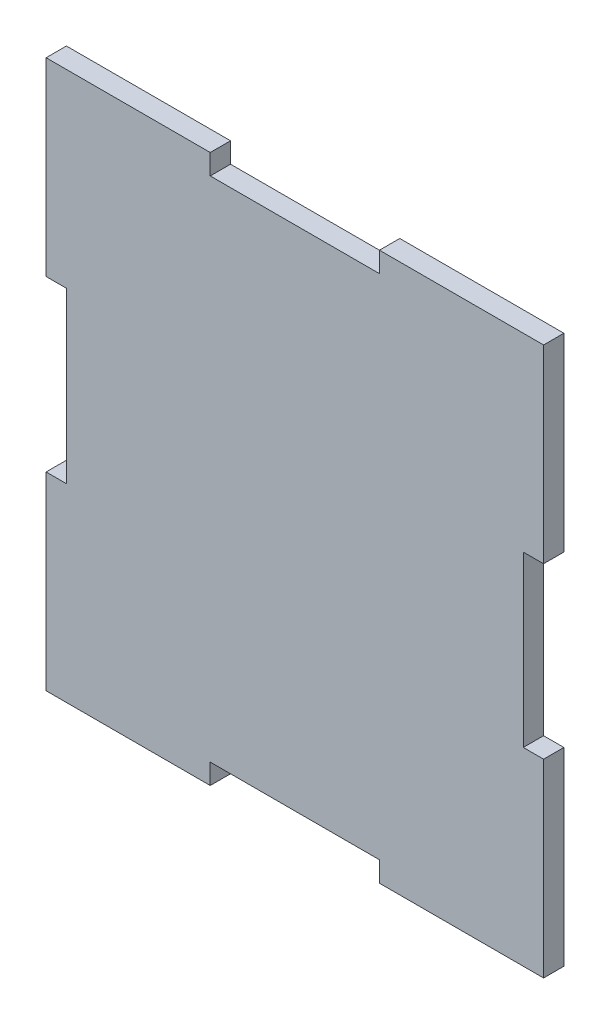
ISO-10303-21;
HEADER;
FILE_DESCRIPTION(('STEP AP214'),'2;1');
FILE_NAME('part.step','',(''),(''),'','','');
FILE_SCHEMA(('AUTOMOTIVE_DESIGN { 1 0 10303 214 1 1 1 1 }'));
ENDSEC;
DATA;
#1=APPLICATION_CONTEXT('core data for automotive mechanical design processes');
#2=APPLICATION_PROTOCOL_DEFINITION('international standard','automotive_design',2000,#1);
#3=PRODUCT_CONTEXT('',#1,'mechanical');
#4=PRODUCT('Part','Part','',(#3));
#5=PRODUCT_RELATED_PRODUCT_CATEGORY('part','',(#4));
#6=PRODUCT_DEFINITION_FORMATION('','',#4);
#7=PRODUCT_DEFINITION_CONTEXT('part definition',#1,'design');
#8=PRODUCT_DEFINITION('design','',#6,#7);
#9=PRODUCT_DEFINITION_SHAPE('','',#8);
#10=(LENGTH_UNIT() NAMED_UNIT(*) SI_UNIT(.MILLI.,.METRE.));
#11=(NAMED_UNIT(*) PLANE_ANGLE_UNIT() SI_UNIT($,.RADIAN.));
#12=(NAMED_UNIT(*) SI_UNIT($,.STERADIAN.) SOLID_ANGLE_UNIT());
#13=UNCERTAINTY_MEASURE_WITH_UNIT(LENGTH_MEASURE(1.E-05),#10,'distance_accuracy_value','');
#14=(GEOMETRIC_REPRESENTATION_CONTEXT(3) GLOBAL_UNCERTAINTY_ASSIGNED_CONTEXT((#13)) GLOBAL_UNIT_ASSIGNED_CONTEXT((#10,
#11,#12)) REPRESENTATION_CONTEXT('',''));
#15=CARTESIAN_POINT('',(0.,0.,0.));
#16=DIRECTION('',(0.,0.,1.));
#17=DIRECTION('',(1.,0.,0.));
#18=AXIS2_PLACEMENT_3D('',#15,#16,#17);
#19=CARTESIAN_POINT('',(-67.4999999999999,0.,6.));
#20=DIRECTION('',(-1.,0.,0.));
#21=DIRECTION('',(0.,0.,1.));
#22=AXIS2_PLACEMENT_3D('',#19,#20,#21);
#23=PLANE('',#22);
#24=DIRECTION('',(0.,1.,0.));
#25=VECTOR('',#24,1.);
#26=CARTESIAN_POINT('',(-67.4999999999999,0.,0.));
#27=LINE('',#26,#25);
#28=CARTESIAN_POINT('',(-67.4999999999999,-25.0000000000058,0.));
#29=VERTEX_POINT('',#28);
#30=CARTESIAN_POINT('',(-67.4999999999999,24.9999999999942,0.));
#31=VERTEX_POINT('',#30);
#32=EDGE_CURVE('E199',#29,#31,#27,.T.);
#33=ORIENTED_EDGE('',*,*,#32,.F.);
#34=DIRECTION('',(0.,0.,-1.));
#35=VECTOR('',#34,1.);
#36=CARTESIAN_POINT('',(-67.4999999999999,-25.0000000000058,6.));
#37=LINE('',#36,#35);
#38=CARTESIAN_POINT('',(-67.4999999999999,-25.0000000000058,6.));
#39=VERTEX_POINT('',#38);
#40=EDGE_CURVE('E11',#39,#29,#37,.T.);
#41=ORIENTED_EDGE('',*,*,#40,.F.);
#42=DIRECTION('',(0.,1.,0.));
#43=VECTOR('',#42,1.);
#44=CARTESIAN_POINT('',(-67.4999999999999,0.,6.));
#45=LINE('',#44,#43);
#46=CARTESIAN_POINT('',(-67.4999999999999,24.9999999999942,6.));
#47=VERTEX_POINT('',#46);
#48=EDGE_CURVE('E251',#39,#47,#45,.T.);
#49=ORIENTED_EDGE('',*,*,#48,.T.);
#50=DIRECTION('',(0.,0.,-1.));
#51=VECTOR('',#50,1.);
#52=CARTESIAN_POINT('',(-67.4999999999999,24.9999999999942,6.));
#53=LINE('',#52,#51);
#54=EDGE_CURVE('E120',#47,#31,#53,.T.);
#55=ORIENTED_EDGE('',*,*,#54,.T.);
#56=EDGE_LOOP('',(#33,#41,#49,#55));
#57=FACE_BOUND('',#56,.T.);
#58=ADVANCED_FACE('F34',(#57),#23,.T.);
#59=CARTESIAN_POINT('',(0.,-25.0000000000056,6.));
#60=DIRECTION('',(0.,1.,0.));
#61=DIRECTION('',(-1.,0.,0.));
#62=AXIS2_PLACEMENT_3D('',#59,#60,#61);
#63=PLANE('',#62);
#64=DIRECTION('',(1.,0.,0.));
#65=VECTOR('',#64,1.);
#66=CARTESIAN_POINT('',(0.,-25.0000000000056,0.));
#67=LINE('',#66,#65);
#68=CARTESIAN_POINT('',(-73.4999999999999,-25.0000000000058,0.));
#69=VERTEX_POINT('',#68);
#70=EDGE_CURVE('E202',#69,#29,#67,.T.);
#71=ORIENTED_EDGE('',*,*,#70,.F.);
#72=DIRECTION('',(0.,0.,-1.));
#73=VECTOR('',#72,1.);
#74=CARTESIAN_POINT('',(-73.4999999999999,-25.0000000000058,6.));
#75=LINE('',#74,#73);
#76=CARTESIAN_POINT('',(-73.4999999999999,-25.0000000000058,6.));
#77=VERTEX_POINT('',#76);
#78=EDGE_CURVE('E42',#77,#69,#75,.T.);
#79=ORIENTED_EDGE('',*,*,#78,.F.);
#80=DIRECTION('',(1.,0.,0.));
#81=VECTOR('',#80,1.);
#82=CARTESIAN_POINT('',(0.,-25.0000000000056,6.));
#83=LINE('',#82,#81);
#84=EDGE_CURVE('E300',#77,#39,#83,.T.);
#85=ORIENTED_EDGE('',*,*,#84,.T.);
#86=ORIENTED_EDGE('',*,*,#40,.T.);
#87=EDGE_LOOP('',(#71,#79,#85,#86));
#88=FACE_BOUND('',#87,.T.);
#89=ADVANCED_FACE('F299',(#88),#63,.T.);
#90=CARTESIAN_POINT('',(-73.4999999999999,0.,6.));
#91=DIRECTION('',(1.,0.,0.));
#92=DIRECTION('',(0.,0.,-1.));
#93=AXIS2_PLACEMENT_3D('',#90,#91,#92);
#94=PLANE('',#93);
#95=DIRECTION('',(0.,-1.,0.));
#96=VECTOR('',#95,1.);
#97=CARTESIAN_POINT('',(-73.4999999999999,0.,0.));
#98=LINE('',#97,#96);
#99=CARTESIAN_POINT('',(-73.4999999999999,-80.9999999999941,0.));
#100=VERTEX_POINT('',#99);
#101=EDGE_CURVE('E205',#69,#100,#98,.T.);
#102=ORIENTED_EDGE('',*,*,#101,.T.);
#103=DIRECTION('',(0.,0.,-1.));
#104=VECTOR('',#103,1.);
#105=CARTESIAN_POINT('',(-73.4999999999999,-80.9999999999941,6.));
#106=LINE('',#105,#104);
#107=CARTESIAN_POINT('',(-73.4999999999999,-80.9999999999941,6.));
#108=VERTEX_POINT('',#107);
#109=EDGE_CURVE('E283',#108,#100,#106,.T.);
#110=ORIENTED_EDGE('',*,*,#109,.F.);
#111=DIRECTION('',(0.,-1.,0.));
#112=VECTOR('',#111,1.);
#113=CARTESIAN_POINT('',(-73.4999999999999,0.,6.));
#114=LINE('',#113,#112);
#115=EDGE_CURVE('E290',#77,#108,#114,.T.);
#116=ORIENTED_EDGE('',*,*,#115,.F.);
#117=ORIENTED_EDGE('',*,*,#78,.T.);
#118=EDGE_LOOP('',(#102,#110,#116,#117));
#119=FACE_BOUND('',#118,.T.);
#120=ADVANCED_FACE('F288',(#119),#94,.F.);
#121=CARTESIAN_POINT('',(0.,-80.9999999999942,6.));
#122=DIRECTION('',(0.,1.,0.));
#123=DIRECTION('',(-1.,0.,0.));
#124=AXIS2_PLACEMENT_3D('',#121,#122,#123);
#125=PLANE('',#124);
#126=DIRECTION('',(1.,0.,0.));
#127=VECTOR('',#126,1.);
#128=CARTESIAN_POINT('',(0.,-80.9999999999942,0.));
#129=LINE('',#128,#127);
#130=CARTESIAN_POINT('',(-24.9999999999999,-80.9999999999941,0.));
#131=VERTEX_POINT('',#130);
#132=EDGE_CURVE('E207',#100,#131,#129,.T.);
#133=ORIENTED_EDGE('',*,*,#132,.T.);
#134=DIRECTION('',(0.,0.,-1.));
#135=VECTOR('',#134,1.);
#136=CARTESIAN_POINT('',(-24.9999999999999,-80.9999999999941,6.));
#137=LINE('',#136,#135);
#138=CARTESIAN_POINT('',(-24.9999999999999,-80.9999999999941,6.));
#139=VERTEX_POINT('',#138);
#140=EDGE_CURVE('E280',#139,#131,#137,.T.);
#141=ORIENTED_EDGE('',*,*,#140,.F.);
#142=DIRECTION('',(1.,0.,0.));
#143=VECTOR('',#142,1.);
#144=CARTESIAN_POINT('',(0.,-80.9999999999942,6.));
#145=LINE('',#144,#143);
#146=EDGE_CURVE('E308',#108,#139,#145,.T.);
#147=ORIENTED_EDGE('',*,*,#146,.F.);
#148=ORIENTED_EDGE('',*,*,#109,.T.);
#149=EDGE_LOOP('',(#133,#141,#147,#148));
#150=FACE_BOUND('',#149,.T.);
#151=ADVANCED_FACE('F395',(#150),#125,.F.);
#152=CARTESIAN_POINT('',(-24.9999999999783,6.66422935355133E-12,6.));
#153=DIRECTION('',(-1.,2.66569174142285E-13,0.));
#154=DIRECTION('',(-2.66569174142285E-13,-1.,0.));
#155=AXIS2_PLACEMENT_3D('',#152,#153,#154);
#156=PLANE('',#155);
#157=DIRECTION('',(2.66569174142285E-13,1.,0.));
#158=VECTOR('',#157,1.);
#159=CARTESIAN_POINT('',(-24.9999999999783,6.66422935355133E-12,0.));
#160=LINE('',#159,#158);
#161=CARTESIAN_POINT('',(-24.9999999999983,-75.0000000000057,0.));
#162=VERTEX_POINT('',#161);
#163=EDGE_CURVE('E209',#131,#162,#160,.T.);
#164=ORIENTED_EDGE('',*,*,#163,.T.);
#165=DIRECTION('',(0.,0.,-1.));
#166=VECTOR('',#165,1.);
#167=CARTESIAN_POINT('',(-24.9999999999983,-75.0000000000057,6.));
#168=LINE('',#167,#166);
#169=CARTESIAN_POINT('',(-24.9999999999983,-75.0000000000057,6.));
#170=VERTEX_POINT('',#169);
#171=EDGE_CURVE('E278',#170,#162,#168,.T.);
#172=ORIENTED_EDGE('',*,*,#171,.F.);
#173=DIRECTION('',(2.66569174142285E-13,1.,0.));
#174=VECTOR('',#173,1.);
#175=CARTESIAN_POINT('',(-24.9999999999783,6.66422935355133E-12,6.));
#176=LINE('',#175,#174);
#177=EDGE_CURVE('E310',#139,#170,#176,.T.);
#178=ORIENTED_EDGE('',*,*,#177,.F.);
#179=ORIENTED_EDGE('',*,*,#140,.T.);
#180=EDGE_LOOP('',(#164,#172,#178,#179));
#181=FACE_BOUND('',#180,.T.);
#182=ADVANCED_FACE('F390',(#181),#156,.F.);
#183=CARTESIAN_POINT('',(0.,-75.0000000000058,6.));
#184=DIRECTION('',(0.,-1.,0.));
#185=DIRECTION('',(1.,0.,0.));
#186=AXIS2_PLACEMENT_3D('',#183,#184,#185);
#187=PLANE('',#186);
#188=DIRECTION('',(-1.,0.,0.));
#189=VECTOR('',#188,1.);
#190=CARTESIAN_POINT('',(0.,-75.0000000000058,0.));
#191=LINE('',#190,#189);
#192=CARTESIAN_POINT('',(25.0000000000001,-75.0000000000058,0.));
#193=VERTEX_POINT('',#192);
#194=EDGE_CURVE('E212',#193,#162,#191,.T.);
#195=ORIENTED_EDGE('',*,*,#194,.F.);
#196=DIRECTION('',(0.,0.,-1.));
#197=VECTOR('',#196,1.);
#198=CARTESIAN_POINT('',(25.0000000000001,-75.0000000000058,6.));
#199=LINE('',#198,#197);
#200=CARTESIAN_POINT('',(25.0000000000001,-75.0000000000058,6.));
#201=VERTEX_POINT('',#200);
#202=EDGE_CURVE('E276',#201,#193,#199,.T.);
#203=ORIENTED_EDGE('',*,*,#202,.F.);
#204=DIRECTION('',(-1.,0.,0.));
#205=VECTOR('',#204,1.);
#206=CARTESIAN_POINT('',(0.,-75.0000000000058,6.));
#207=LINE('',#206,#205);
#208=EDGE_CURVE('E312',#201,#170,#207,.T.);
#209=ORIENTED_EDGE('',*,*,#208,.T.);
#210=ORIENTED_EDGE('',*,*,#171,.T.);
#211=EDGE_LOOP('',(#195,#203,#209,#210));
#212=FACE_BOUND('',#211,.T.);
#213=ADVANCED_FACE('F387',(#212),#187,.T.);
#214=CARTESIAN_POINT('',(24.9999999999997,1.44560289664733E-13,6.));
#215=DIRECTION('',(-1.,0.,0.));
#216=DIRECTION('',(0.,-1.,0.));
#217=AXIS2_PLACEMENT_3D('',#214,#215,#216);
#218=PLANE('',#217);
#219=DIRECTION('',(0.,1.,0.));
#220=VECTOR('',#219,1.);
#221=CARTESIAN_POINT('',(24.9999999999997,1.44560289664733E-13,0.));
#222=LINE('',#221,#220);
#223=CARTESIAN_POINT('',(25.0000000000001,-81.0000000000057,0.));
#224=VERTEX_POINT('',#223);
#225=EDGE_CURVE('E215',#224,#193,#222,.T.);
#226=ORIENTED_EDGE('',*,*,#225,.F.);
#227=DIRECTION('',(0.,0.,-1.));
#228=VECTOR('',#227,1.);
#229=CARTESIAN_POINT('',(25.0000000000001,-81.0000000000057,6.));
#230=LINE('',#229,#228);
#231=CARTESIAN_POINT('',(25.0000000000001,-81.0000000000057,6.));
#232=VERTEX_POINT('',#231);
#233=EDGE_CURVE('E274',#232,#224,#230,.T.);
#234=ORIENTED_EDGE('',*,*,#233,.F.);
#235=DIRECTION('',(0.,1.,0.));
#236=VECTOR('',#235,1.);
#237=CARTESIAN_POINT('',(24.9999999999997,1.44560289664733E-13,6.));
#238=LINE('',#237,#236);
#239=EDGE_CURVE('E315',#232,#201,#238,.T.);
#240=ORIENTED_EDGE('',*,*,#239,.T.);
#241=ORIENTED_EDGE('',*,*,#202,.T.);
#242=EDGE_LOOP('',(#226,#234,#240,#241));
#243=FACE_BOUND('',#242,.T.);
#244=ADVANCED_FACE('F382',(#243),#218,.T.);
#245=CARTESIAN_POINT('',(1.93762531792598E-11,-81.0000000000117,6.));
#246=DIRECTION('',(-2.3921300221305E-13,1.,0.));
#247=DIRECTION('',(-1.,-2.3921300221305E-13,0.));
#248=AXIS2_PLACEMENT_3D('',#245,#246,#247);
#249=PLANE('',#248);
#250=DIRECTION('',(1.,2.3921300221305E-13,0.));
#251=VECTOR('',#250,1.);
#252=CARTESIAN_POINT('',(1.93762531792598E-11,-81.0000000000117,0.));
#253=LINE('',#252,#251);
#254=CARTESIAN_POINT('',(73.5,-80.9999999999941,0.));
#255=VERTEX_POINT('',#254);
#256=EDGE_CURVE('E218',#224,#255,#253,.T.);
#257=ORIENTED_EDGE('',*,*,#256,.T.);
#258=DIRECTION('',(0.,0.,-1.));
#259=VECTOR('',#258,1.);
#260=CARTESIAN_POINT('',(73.5,-80.9999999999941,6.));
#261=LINE('',#260,#259);
#262=CARTESIAN_POINT('',(73.5,-80.9999999999941,6.));
#263=VERTEX_POINT('',#262);
#264=EDGE_CURVE('E272',#263,#255,#261,.T.);
#265=ORIENTED_EDGE('',*,*,#264,.F.);
#266=DIRECTION('',(1.,2.3921300221305E-13,0.));
#267=VECTOR('',#266,1.);
#268=CARTESIAN_POINT('',(1.93762531792598E-11,-81.0000000000117,6.));
#269=LINE('',#268,#267);
#270=EDGE_CURVE('E318',#232,#263,#269,.T.);
#271=ORIENTED_EDGE('',*,*,#270,.F.);
#272=ORIENTED_EDGE('',*,*,#233,.T.);
#273=EDGE_LOOP('',(#257,#265,#271,#272));
#274=FACE_BOUND('',#273,.T.);
#275=ADVANCED_FACE('F379',(#274),#249,.F.);
#276=CARTESIAN_POINT('',(73.5000000000002,-1.45716771982082E-13,6.));
#277=DIRECTION('',(1.,0.,0.));
#278=DIRECTION('',(0.,1.,0.));
#279=AXIS2_PLACEMENT_3D('',#276,#277,#278);
#280=PLANE('',#279);
#281=DIRECTION('',(0.,-1.,0.));
#282=VECTOR('',#281,1.);
#283=CARTESIAN_POINT('',(73.5000000000002,-1.45716771982082E-13,0.));
#284=LINE('',#283,#282);
#285=CARTESIAN_POINT('',(73.5000000000001,-25.0000000000058,0.));
#286=VERTEX_POINT('',#285);
#287=EDGE_CURVE('E221',#286,#255,#284,.T.);
#288=ORIENTED_EDGE('',*,*,#287,.F.);
#289=DIRECTION('',(0.,0.,-1.));
#290=VECTOR('',#289,1.);
#291=CARTESIAN_POINT('',(73.5000000000001,-25.0000000000058,6.));
#292=LINE('',#291,#290);
#293=CARTESIAN_POINT('',(73.5000000000001,-25.0000000000058,6.));
#294=VERTEX_POINT('',#293);
#295=EDGE_CURVE('E270',#294,#286,#292,.T.);
#296=ORIENTED_EDGE('',*,*,#295,.F.);
#297=DIRECTION('',(0.,-1.,0.));
#298=VECTOR('',#297,1.);
#299=CARTESIAN_POINT('',(73.5000000000002,-1.45716771982082E-13,6.));
#300=LINE('',#299,#298);
#301=EDGE_CURVE('E320',#294,#263,#300,.T.);
#302=ORIENTED_EDGE('',*,*,#301,.T.);
#303=ORIENTED_EDGE('',*,*,#264,.T.);
#304=EDGE_LOOP('',(#288,#296,#302,#303));
#305=FACE_BOUND('',#304,.T.);
#306=ADVANCED_FACE('F374',(#305),#280,.T.);
#307=CARTESIAN_POINT('',(2.89120579329539E-13,-25.0000000000066,6.));
#308=DIRECTION('',(0.,-1.,0.));
#309=DIRECTION('',(1.,0.,0.));
#310=AXIS2_PLACEMENT_3D('',#307,#308,#309);
#311=PLANE('',#310);
#312=DIRECTION('',(-1.,0.,0.));
#313=VECTOR('',#312,1.);
#314=CARTESIAN_POINT('',(2.89120579329539E-13,-25.0000000000066,0.));
#315=LINE('',#314,#313);
#316=CARTESIAN_POINT('',(67.5,-25.0000000000058,0.));
#317=VERTEX_POINT('',#316);
#318=EDGE_CURVE('E224',#286,#317,#315,.T.);
#319=ORIENTED_EDGE('',*,*,#318,.T.);
#320=DIRECTION('',(0.,0.,-1.));
#321=VECTOR('',#320,1.);
#322=CARTESIAN_POINT('',(67.5,-25.0000000000058,6.));
#323=LINE('',#322,#321);
#324=CARTESIAN_POINT('',(67.5,-25.0000000000058,6.));
#325=VERTEX_POINT('',#324);
#326=EDGE_CURVE('E268',#325,#317,#323,.T.);
#327=ORIENTED_EDGE('',*,*,#326,.F.);
#328=DIRECTION('',(-1.,0.,0.));
#329=VECTOR('',#328,1.);
#330=CARTESIAN_POINT('',(2.89120579329539E-13,-25.0000000000066,6.));
#331=LINE('',#330,#329);
#332=EDGE_CURVE('E323',#294,#325,#331,.T.);
#333=ORIENTED_EDGE('',*,*,#332,.F.);
#334=ORIENTED_EDGE('',*,*,#295,.T.);
#335=EDGE_LOOP('',(#319,#327,#333,#334));
#336=FACE_BOUND('',#335,.T.);
#337=ADVANCED_FACE('F370',(#336),#311,.F.);
#338=CARTESIAN_POINT('',(67.5000000000001,0.,6.));
#339=DIRECTION('',(1.,0.,0.));
#340=DIRECTION('',(0.,1.,0.));
#341=AXIS2_PLACEMENT_3D('',#338,#339,#340);
#342=PLANE('',#341);
#343=DIRECTION('',(0.,-1.,0.));
#344=VECTOR('',#343,1.);
#345=CARTESIAN_POINT('',(67.5000000000001,0.,0.));
#346=LINE('',#345,#344);
#347=CARTESIAN_POINT('',(67.5000000000001,24.9999999999942,0.));
#348=VERTEX_POINT('',#347);
#349=EDGE_CURVE('E227',#348,#317,#346,.T.);
#350=ORIENTED_EDGE('',*,*,#349,.F.);
#351=DIRECTION('',(0.,0.,-1.));
#352=VECTOR('',#351,1.);
#353=CARTESIAN_POINT('',(67.5000000000001,24.9999999999942,6.));
#354=LINE('',#353,#352);
#355=CARTESIAN_POINT('',(67.5000000000001,24.9999999999942,6.));
#356=VERTEX_POINT('',#355);
#357=EDGE_CURVE('E266',#356,#348,#354,.T.);
#358=ORIENTED_EDGE('',*,*,#357,.F.);
#359=DIRECTION('',(0.,-1.,0.));
#360=VECTOR('',#359,1.);
#361=CARTESIAN_POINT('',(67.5000000000001,0.,6.));
#362=LINE('',#361,#360);
#363=EDGE_CURVE('E325',#356,#325,#362,.T.);
#364=ORIENTED_EDGE('',*,*,#363,.T.);
#365=ORIENTED_EDGE('',*,*,#326,.T.);
#366=EDGE_LOOP('',(#350,#358,#364,#365));
#367=FACE_BOUND('',#366,.T.);
#368=ADVANCED_FACE('F366',(#367),#342,.T.);
#369=CARTESIAN_POINT('',(-3.03576608295856E-13,24.9999999999933,6.));
#370=DIRECTION('',(0.,-1.,0.));
#371=DIRECTION('',(1.,0.,0.));
#372=AXIS2_PLACEMENT_3D('',#369,#370,#371);
#373=PLANE('',#372);
#374=DIRECTION('',(-1.,0.,0.));
#375=VECTOR('',#374,1.);
#376=CARTESIAN_POINT('',(-3.03576608295856E-13,24.9999999999933,0.));
#377=LINE('',#376,#375);
#378=CARTESIAN_POINT('',(73.5000000000001,24.9999999999942,0.));
#379=VERTEX_POINT('',#378);
#380=EDGE_CURVE('E230',#379,#348,#377,.T.);
#381=ORIENTED_EDGE('',*,*,#380,.F.);
#382=DIRECTION('',(0.,0.,-1.));
#383=VECTOR('',#382,1.);
#384=CARTESIAN_POINT('',(73.5000000000001,24.9999999999942,6.));
#385=LINE('',#384,#383);
#386=CARTESIAN_POINT('',(73.5000000000001,24.9999999999942,6.));
#387=VERTEX_POINT('',#386);
#388=EDGE_CURVE('E264',#387,#379,#385,.T.);
#389=ORIENTED_EDGE('',*,*,#388,.F.);
#390=DIRECTION('',(-1.,0.,0.));
#391=VECTOR('',#390,1.);
#392=CARTESIAN_POINT('',(-3.03576608295856E-13,24.9999999999933,6.));
#393=LINE('',#392,#391);
#394=EDGE_CURVE('E328',#387,#356,#393,.T.);
#395=ORIENTED_EDGE('',*,*,#394,.T.);
#396=ORIENTED_EDGE('',*,*,#357,.T.);
#397=EDGE_LOOP('',(#381,#389,#395,#396));
#398=FACE_BOUND('',#397,.T.);
#399=ADVANCED_FACE('F362',(#398),#373,.T.);
#400=CARTESIAN_POINT('',(73.5000000000002,1.63931368479809E-13,6.));
#401=DIRECTION('',(1.,0.,0.));
#402=DIRECTION('',(0.,1.,0.));
#403=AXIS2_PLACEMENT_3D('',#400,#401,#402);
#404=PLANE('',#403);
#405=DIRECTION('',(0.,-1.,0.));
#406=VECTOR('',#405,1.);
#407=CARTESIAN_POINT('',(73.5000000000002,1.63931368479809E-13,0.));
#408=LINE('',#407,#406);
#409=CARTESIAN_POINT('',(73.5,80.9999999999942,0.));
#410=VERTEX_POINT('',#409);
#411=EDGE_CURVE('E233',#410,#379,#408,.T.);
#412=ORIENTED_EDGE('',*,*,#411,.F.);
#413=DIRECTION('',(0.,0.,-1.));
#414=VECTOR('',#413,1.);
#415=CARTESIAN_POINT('',(73.5,80.9999999999942,6.));
#416=LINE('',#415,#414);
#417=CARTESIAN_POINT('',(73.5,80.9999999999942,6.));
#418=VERTEX_POINT('',#417);
#419=EDGE_CURVE('E262',#418,#410,#416,.T.);
#420=ORIENTED_EDGE('',*,*,#419,.F.);
#421=DIRECTION('',(0.,-1.,0.));
#422=VECTOR('',#421,1.);
#423=CARTESIAN_POINT('',(73.5000000000002,1.63931368479809E-13,6.));
#424=LINE('',#423,#422);
#425=EDGE_CURVE('E331',#418,#387,#424,.T.);
#426=ORIENTED_EDGE('',*,*,#425,.T.);
#427=ORIENTED_EDGE('',*,*,#388,.T.);
#428=EDGE_LOOP('',(#412,#420,#426,#427));
#429=FACE_BOUND('',#428,.T.);
#430=ADVANCED_FACE('F357',(#429),#404,.T.);
#431=CARTESIAN_POINT('',(0.,80.9999999999943,6.));
#432=DIRECTION('',(0.,1.,0.));
#433=DIRECTION('',(-1.,0.,0.));
#434=AXIS2_PLACEMENT_3D('',#431,#432,#433);
#435=PLANE('',#434);
#436=DIRECTION('',(1.,0.,0.));
#437=VECTOR('',#436,1.);
#438=CARTESIAN_POINT('',(0.,80.9999999999943,0.));
#439=LINE('',#438,#437);
#440=CARTESIAN_POINT('',(25.0000000000002,80.9999999999943,0.));
#441=VERTEX_POINT('',#440);
#442=EDGE_CURVE('E236',#441,#410,#439,.T.);
#443=ORIENTED_EDGE('',*,*,#442,.F.);
#444=DIRECTION('',(0.,0.,-1.));
#445=VECTOR('',#444,1.);
#446=CARTESIAN_POINT('',(25.0000000000002,80.9999999999943,6.));
#447=LINE('',#446,#445);
#448=CARTESIAN_POINT('',(25.0000000000002,80.9999999999943,6.));
#449=VERTEX_POINT('',#448);
#450=EDGE_CURVE('E260',#449,#441,#447,.T.);
#451=ORIENTED_EDGE('',*,*,#450,.F.);
#452=DIRECTION('',(1.,0.,0.));
#453=VECTOR('',#452,1.);
#454=CARTESIAN_POINT('',(0.,80.9999999999943,6.));
#455=LINE('',#454,#453);
#456=EDGE_CURVE('E334',#449,#418,#455,.T.);
#457=ORIENTED_EDGE('',*,*,#456,.T.);
#458=ORIENTED_EDGE('',*,*,#419,.T.);
#459=EDGE_LOOP('',(#443,#451,#457,#458));
#460=FACE_BOUND('',#459,.T.);
#461=ADVANCED_FACE('F353',(#460),#435,.T.);
#462=CARTESIAN_POINT('',(25.0000000000004,0.,6.));
#463=DIRECTION('',(1.,0.,0.));
#464=DIRECTION('',(0.,1.,0.));
#465=AXIS2_PLACEMENT_3D('',#462,#463,#464);
#466=PLANE('',#465);
#467=DIRECTION('',(0.,-1.,0.));
#468=VECTOR('',#467,1.);
#469=CARTESIAN_POINT('',(25.0000000000004,0.,0.));
#470=LINE('',#469,#468);
#471=CARTESIAN_POINT('',(25.0000000000002,74.9999999999943,0.));
#472=VERTEX_POINT('',#471);
#473=EDGE_CURVE('E239',#441,#472,#470,.T.);
#474=ORIENTED_EDGE('',*,*,#473,.T.);
#475=DIRECTION('',(0.,0.,-1.));
#476=VECTOR('',#475,1.);
#477=CARTESIAN_POINT('',(25.0000000000002,74.9999999999943,6.));
#478=LINE('',#477,#476);
#479=CARTESIAN_POINT('',(25.0000000000002,74.9999999999943,6.));
#480=VERTEX_POINT('',#479);
#481=EDGE_CURVE('E257',#480,#472,#478,.T.);
#482=ORIENTED_EDGE('',*,*,#481,.F.);
#483=DIRECTION('',(0.,-1.,0.));
#484=VECTOR('',#483,1.);
#485=CARTESIAN_POINT('',(25.0000000000004,0.,6.));
#486=LINE('',#485,#484);
#487=EDGE_CURVE('E337',#449,#480,#486,.T.);
#488=ORIENTED_EDGE('',*,*,#487,.F.);
#489=ORIENTED_EDGE('',*,*,#450,.T.);
#490=EDGE_LOOP('',(#474,#482,#488,#489));
#491=FACE_BOUND('',#490,.T.);
#492=ADVANCED_FACE('F497',(#491),#466,.F.);
#493=CARTESIAN_POINT('',(0.,74.9999999999943,6.));
#494=DIRECTION('',(0.,-1.,0.));
#495=DIRECTION('',(0.,0.,-1.));
#496=AXIS2_PLACEMENT_3D('',#493,#494,#495);
#497=PLANE('',#496);
#498=DIRECTION('',(-1.,0.,0.));
#499=VECTOR('',#498,1.);
#500=CARTESIAN_POINT('',(0.,74.9999999999943,0.));
#501=LINE('',#500,#499);
#502=CARTESIAN_POINT('',(-24.9999999999998,74.9999999999943,0.));
#503=VERTEX_POINT('',#502);
#504=EDGE_CURVE('E241',#472,#503,#501,.T.);
#505=ORIENTED_EDGE('',*,*,#504,.T.);
#506=DIRECTION('',(0.,0.,-1.));
#507=VECTOR('',#506,1.);
#508=CARTESIAN_POINT('',(-24.9999999999998,74.9999999999943,6.));
#509=LINE('',#508,#507);
#510=CARTESIAN_POINT('',(-24.9999999999998,74.9999999999943,6.));
#511=VERTEX_POINT('',#510);
#512=EDGE_CURVE('E255',#511,#503,#509,.T.);
#513=ORIENTED_EDGE('',*,*,#512,.F.);
#514=DIRECTION('',(-1.,0.,0.));
#515=VECTOR('',#514,1.);
#516=CARTESIAN_POINT('',(0.,74.9999999999943,6.));
#517=LINE('',#516,#515);
#518=EDGE_CURVE('E194',#480,#511,#517,.T.);
#519=ORIENTED_EDGE('',*,*,#518,.F.);
#520=ORIENTED_EDGE('',*,*,#481,.T.);
#521=EDGE_LOOP('',(#505,#513,#519,#520));
#522=FACE_BOUND('',#521,.T.);
#523=ADVANCED_FACE('F344',(#522),#497,.F.);
#524=CARTESIAN_POINT('',(-24.9999999999988,-3.46944695195347E-13,6.));
#525=DIRECTION('',(1.,0.,0.));
#526=DIRECTION('',(0.,1.,0.));
#527=AXIS2_PLACEMENT_3D('',#524,#525,#526);
#528=PLANE('',#527);
#529=DIRECTION('',(0.,-1.,0.));
#530=VECTOR('',#529,1.);
#531=CARTESIAN_POINT('',(-24.9999999999988,-3.46944695195347E-13,0.));
#532=LINE('',#531,#530);
#533=CARTESIAN_POINT('',(-24.9999999999999,80.9999999999942,0.));
#534=VERTEX_POINT('',#533);
#535=EDGE_CURVE('E244',#534,#503,#532,.T.);
#536=ORIENTED_EDGE('',*,*,#535,.F.);
#537=DIRECTION('',(0.,0.,-1.));
#538=VECTOR('',#537,1.);
#539=CARTESIAN_POINT('',(-24.9999999999999,80.9999999999942,6.));
#540=LINE('',#539,#538);
#541=CARTESIAN_POINT('',(-24.9999999999999,80.9999999999942,6.));
#542=VERTEX_POINT('',#541);
#543=EDGE_CURVE('E183',#542,#534,#540,.T.);
#544=ORIENTED_EDGE('',*,*,#543,.F.);
#545=DIRECTION('',(0.,-1.,0.));
#546=VECTOR('',#545,1.);
#547=CARTESIAN_POINT('',(-24.9999999999988,-3.46944695195347E-13,6.));
#548=LINE('',#547,#546);
#549=EDGE_CURVE('E192',#542,#511,#548,.T.);
#550=ORIENTED_EDGE('',*,*,#549,.T.);
#551=ORIENTED_EDGE('',*,*,#512,.T.);
#552=EDGE_LOOP('',(#536,#544,#550,#551));
#553=FACE_BOUND('',#552,.T.);
#554=ADVANCED_FACE('F348',(#553),#528,.T.);
#555=CARTESIAN_POINT('',(0.,80.9999999999942,6.));
#556=DIRECTION('',(0.,1.,0.));
#557=DIRECTION('',(0.,0.,1.));
#558=AXIS2_PLACEMENT_3D('',#555,#556,#557);
#559=PLANE('',#558);
#560=DIRECTION('',(1.,0.,0.));
#561=VECTOR('',#560,1.);
#562=CARTESIAN_POINT('',(0.,80.9999999999942,0.));
#563=LINE('',#562,#561);
#564=CARTESIAN_POINT('',(-73.5,80.9999999999942,0.));
#565=VERTEX_POINT('',#564);
#566=EDGE_CURVE('E182',#565,#534,#563,.T.);
#567=ORIENTED_EDGE('',*,*,#566,.F.);
#568=DIRECTION('',(0.,0.,-1.));
#569=VECTOR('',#568,1.);
#570=CARTESIAN_POINT('',(-73.5,80.9999999999942,6.));
#571=LINE('',#570,#569);
#572=CARTESIAN_POINT('',(-73.5,80.9999999999942,6.));
#573=VERTEX_POINT('',#572);
#574=EDGE_CURVE('E176',#573,#565,#571,.T.);
#575=ORIENTED_EDGE('',*,*,#574,.F.);
#576=DIRECTION('',(1.,0.,0.));
#577=VECTOR('',#576,1.);
#578=CARTESIAN_POINT('',(0.,80.9999999999942,6.));
#579=LINE('',#578,#577);
#580=EDGE_CURVE('E180',#573,#542,#579,.T.);
#581=ORIENTED_EDGE('',*,*,#580,.T.);
#582=ORIENTED_EDGE('',*,*,#543,.T.);
#583=EDGE_LOOP('',(#567,#575,#581,#582));
#584=FACE_BOUND('',#583,.T.);
#585=ADVANCED_FACE('F178',(#584),#559,.T.);
#586=CARTESIAN_POINT('',(-73.4999999999999,0.,6.));
#587=DIRECTION('',(1.,0.,0.));
#588=DIRECTION('',(0.,1.,0.));
#589=AXIS2_PLACEMENT_3D('',#586,#587,#588);
#590=PLANE('',#589);
#591=DIRECTION('',(0.,-1.,0.));
#592=VECTOR('',#591,1.);
#593=CARTESIAN_POINT('',(-73.4999999999999,0.,0.));
#594=LINE('',#593,#592);
#595=CARTESIAN_POINT('',(-73.4999999999999,24.9999999999942,0.));
#596=VERTEX_POINT('',#595);
#597=EDGE_CURVE('E113',#565,#596,#594,.T.);
#598=ORIENTED_EDGE('',*,*,#597,.T.);
#599=DIRECTION('',(0.,0.,-1.));
#600=VECTOR('',#599,1.);
#601=CARTESIAN_POINT('',(-73.4999999999999,24.9999999999942,6.));
#602=LINE('',#601,#600);
#603=CARTESIAN_POINT('',(-73.4999999999999,24.9999999999942,6.));
#604=VERTEX_POINT('',#603);
#605=EDGE_CURVE('E184',#604,#596,#602,.T.);
#606=ORIENTED_EDGE('',*,*,#605,.F.);
#607=DIRECTION('',(0.,-1.,0.));
#608=VECTOR('',#607,1.);
#609=CARTESIAN_POINT('',(-73.4999999999999,0.,6.));
#610=LINE('',#609,#608);
#611=EDGE_CURVE('E186',#573,#604,#610,.T.);
#612=ORIENTED_EDGE('',*,*,#611,.F.);
#613=ORIENTED_EDGE('',*,*,#574,.T.);
#614=EDGE_LOOP('',(#598,#606,#612,#613));
#615=FACE_BOUND('',#614,.T.);
#616=ADVANCED_FACE('F187',(#615),#590,.F.);
#617=CARTESIAN_POINT('',(0.,24.9999999999942,6.));
#618=DIRECTION('',(0.,1.,0.));
#619=DIRECTION('',(0.,0.,1.));
#620=AXIS2_PLACEMENT_3D('',#617,#618,#619);
#621=PLANE('',#620);
#622=DIRECTION('',(1.,0.,0.));
#623=VECTOR('',#622,1.);
#624=CARTESIAN_POINT('',(0.,24.9999999999942,0.));
#625=LINE('',#624,#623);
#626=EDGE_CURVE('E249',#596,#31,#625,.T.);
#627=ORIENTED_EDGE('',*,*,#626,.T.);
#628=ORIENTED_EDGE('',*,*,#54,.F.);
#629=DIRECTION('',(1.,0.,0.));
#630=VECTOR('',#629,1.);
#631=CARTESIAN_POINT('',(0.,24.9999999999942,6.));
#632=LINE('',#631,#630);
#633=EDGE_CURVE('E50',#604,#47,#632,.T.);
#634=ORIENTED_EDGE('',*,*,#633,.F.);
#635=ORIENTED_EDGE('',*,*,#605,.T.);
#636=EDGE_LOOP('',(#627,#628,#634,#635));
#637=FACE_BOUND('',#636,.T.);
#638=ADVANCED_FACE('F303',(#637),#621,.F.);
#639=CARTESIAN_POINT('',(0.,0.,6.));
#640=DIRECTION('',(0.,0.,1.));
#641=DIRECTION('',(1.,0.,0.));
#642=AXIS2_PLACEMENT_3D('',#639,#640,#641);
#643=PLANE('',#642);
#644=ORIENTED_EDGE('',*,*,#48,.F.);
#645=ORIENTED_EDGE('',*,*,#84,.F.);
#646=ORIENTED_EDGE('',*,*,#115,.T.);
#647=ORIENTED_EDGE('',*,*,#146,.T.);
#648=ORIENTED_EDGE('',*,*,#177,.T.);
#649=ORIENTED_EDGE('',*,*,#208,.F.);
#650=ORIENTED_EDGE('',*,*,#239,.F.);
#651=ORIENTED_EDGE('',*,*,#270,.T.);
#652=ORIENTED_EDGE('',*,*,#301,.F.);
#653=ORIENTED_EDGE('',*,*,#332,.T.);
#654=ORIENTED_EDGE('',*,*,#363,.F.);
#655=ORIENTED_EDGE('',*,*,#394,.F.);
#656=ORIENTED_EDGE('',*,*,#425,.F.);
#657=ORIENTED_EDGE('',*,*,#456,.F.);
#658=ORIENTED_EDGE('',*,*,#487,.T.);
#659=ORIENTED_EDGE('',*,*,#518,.T.);
#660=ORIENTED_EDGE('',*,*,#549,.F.);
#661=ORIENTED_EDGE('',*,*,#580,.F.);
#662=ORIENTED_EDGE('',*,*,#611,.T.);
#663=ORIENTED_EDGE('',*,*,#633,.T.);
#664=EDGE_LOOP('',(#644,#645,#646,#647,#648,#649,#650,#651,#652,#653,#654,#655,#656,#657,#658,
#659,#660,#661,#662,#663));
#665=FACE_BOUND('',#664,.T.);
#666=ADVANCED_FACE('F190',(#665),#643,.T.);
#667=CARTESIAN_POINT('',(0.,0.,0.));
#668=DIRECTION('',(0.,0.,1.));
#669=DIRECTION('',(1.,0.,0.));
#670=AXIS2_PLACEMENT_3D('',#667,#668,#669);
#671=PLANE('',#670);
#672=ORIENTED_EDGE('',*,*,#32,.T.);
#673=ORIENTED_EDGE('',*,*,#626,.F.);
#674=ORIENTED_EDGE('',*,*,#597,.F.);
#675=ORIENTED_EDGE('',*,*,#566,.T.);
#676=ORIENTED_EDGE('',*,*,#535,.T.);
#677=ORIENTED_EDGE('',*,*,#504,.F.);
#678=ORIENTED_EDGE('',*,*,#473,.F.);
#679=ORIENTED_EDGE('',*,*,#442,.T.);
#680=ORIENTED_EDGE('',*,*,#411,.T.);
#681=ORIENTED_EDGE('',*,*,#380,.T.);
#682=ORIENTED_EDGE('',*,*,#349,.T.);
#683=ORIENTED_EDGE('',*,*,#318,.F.);
#684=ORIENTED_EDGE('',*,*,#287,.T.);
#685=ORIENTED_EDGE('',*,*,#256,.F.);
#686=ORIENTED_EDGE('',*,*,#225,.T.);
#687=ORIENTED_EDGE('',*,*,#194,.T.);
#688=ORIENTED_EDGE('',*,*,#163,.F.);
#689=ORIENTED_EDGE('',*,*,#132,.F.);
#690=ORIENTED_EDGE('',*,*,#101,.F.);
#691=ORIENTED_EDGE('',*,*,#70,.T.);
#692=EDGE_LOOP('',(#672,#673,#674,#675,#676,#677,#678,#679,#680,#681,#682,#683,#684,#685,#686,
#687,#688,#689,#690,#691));
#693=FACE_BOUND('',#692,.T.);
#694=ADVANCED_FACE('F297',(#693),#671,.F.);
#695=CLOSED_SHELL('',(#58,#89,#120,#151,#182,#213,#244,#275,#306,#337,#368,#399,#430,#461,#492,
#523,#554,#585,#616,#638,#666,#694));
#696=MANIFOLD_SOLID_BREP('B2',#695);
#697=ADVANCED_BREP_SHAPE_REPRESENTATION('',(#18,#696),#14);
#698=SHAPE_DEFINITION_REPRESENTATION(#9,#697);
ENDSEC;
END-ISO-10303-21;
